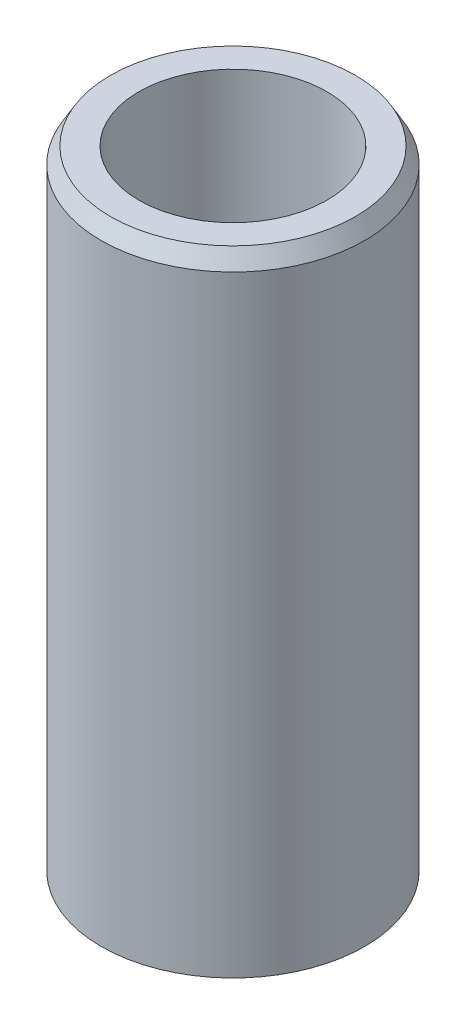
ISO-10303-21;
HEADER;
FILE_DESCRIPTION(('STEP AP214'),'2;1');
FILE_NAME('part.step','',(''),(''),'','','');
FILE_SCHEMA(('AUTOMOTIVE_DESIGN { 1 0 10303 214 1 1 1 1 }'));
ENDSEC;
DATA;
#1=APPLICATION_CONTEXT('core data for automotive mechanical design processes');
#2=APPLICATION_PROTOCOL_DEFINITION('international standard','automotive_design',2000,#1);
#3=PRODUCT_CONTEXT('',#1,'mechanical');
#4=PRODUCT('Part','Part','',(#3));
#5=PRODUCT_RELATED_PRODUCT_CATEGORY('part','',(#4));
#6=PRODUCT_DEFINITION_FORMATION('','',#4);
#7=PRODUCT_DEFINITION_CONTEXT('part definition',#1,'design');
#8=PRODUCT_DEFINITION('design','',#6,#7);
#9=PRODUCT_DEFINITION_SHAPE('','',#8);
#10=(LENGTH_UNIT() NAMED_UNIT(*) SI_UNIT(.MILLI.,.METRE.));
#11=(NAMED_UNIT(*) PLANE_ANGLE_UNIT() SI_UNIT($,.RADIAN.));
#12=(NAMED_UNIT(*) SI_UNIT($,.STERADIAN.) SOLID_ANGLE_UNIT());
#13=UNCERTAINTY_MEASURE_WITH_UNIT(LENGTH_MEASURE(1.E-05),#10,'distance_accuracy_value','');
#14=(GEOMETRIC_REPRESENTATION_CONTEXT(3) GLOBAL_UNCERTAINTY_ASSIGNED_CONTEXT((#13)) GLOBAL_UNIT_ASSIGNED_CONTEXT((#10,
#11,#12)) REPRESENTATION_CONTEXT('',''));
#15=CARTESIAN_POINT('',(0.,0.,0.));
#16=DIRECTION('',(0.,0.,1.));
#17=DIRECTION('',(1.,0.,0.));
#18=AXIS2_PLACEMENT_3D('',#15,#16,#17);
#19=CARTESIAN_POINT('',(0.,72.5231527826411,0.));
#20=DIRECTION('',(0.,-1.,0.));
#21=DIRECTION('',(0.,0.,-1.));
#22=AXIS2_PLACEMENT_3D('',#19,#20,#21);
#23=CYLINDRICAL_SURFACE('',#22,15.);
#24=CARTESIAN_POINT('',(0.,70.6891445540709,0.));
#25=DIRECTION('',(0.,1.,0.));
#26=DIRECTION('',(0.,0.,1.));
#27=AXIS2_PLACEMENT_3D('',#24,#25,#26);
#28=CIRCLE('',#27,15.);
#29=CARTESIAN_POINT('',(0.,70.6891445540709,15.));
#30=VERTEX_POINT('',#29);
#31=EDGE_CURVE('E50',#30,#30,#28,.F.);
#32=ORIENTED_EDGE('',*,*,#31,.T.);
#33=EDGE_LOOP('',(#32));
#34=FACE_BOUND('',#33,.T.);
#35=CARTESIAN_POINT('',(0.,1.05886514446099,0.));
#36=DIRECTION('',(0.,1.,0.));
#37=DIRECTION('',(0.,0.,1.));
#38=AXIS2_PLACEMENT_3D('',#35,#36,#37);
#39=CIRCLE('',#38,15.);
#40=CARTESIAN_POINT('',(0.,1.05886514446099,15.));
#41=VERTEX_POINT('',#40);
#42=EDGE_CURVE('E51',#41,#41,#39,.T.);
#43=ORIENTED_EDGE('',*,*,#42,.T.);
#44=EDGE_LOOP('',(#43));
#45=FACE_BOUND('',#44,.T.);
#46=ADVANCED_FACE('F39',(#34,#45),#23,.T.);
#47=CARTESIAN_POINT('',(0.,72.5231527826411,0.));
#48=DIRECTION('',(0.,1.,0.));
#49=DIRECTION('',(0.,0.,1.));
#50=AXIS2_PLACEMENT_3D('',#47,#48,#49);
#51=PLANE('',#50);
#52=CARTESIAN_POINT('',(0.,72.5231527826411,0.));
#53=DIRECTION('',(0.,1.,0.));
#54=DIRECTION('',(0.,0.,1.));
#55=AXIS2_PLACEMENT_3D('',#52,#53,#54);
#56=CIRCLE('',#55,13.941134855539);
#57=CARTESIAN_POINT('',(0.,72.5231527826411,13.941134855539));
#58=VERTEX_POINT('',#57);
#59=EDGE_CURVE('E54',#58,#58,#56,.T.);
#60=ORIENTED_EDGE('',*,*,#59,.T.);
#61=EDGE_LOOP('',(#60));
#62=FACE_BOUND('',#61,.T.);
#63=CARTESIAN_POINT('',(0.,72.5231527826411,0.));
#64=DIRECTION('',(0.,1.,0.));
#65=DIRECTION('',(0.,0.,1.));
#66=AXIS2_PLACEMENT_3D('',#63,#64,#65);
#67=CIRCLE('',#66,10.7094149764629);
#68=CARTESIAN_POINT('',(0.,72.5231527826411,10.7094149764629));
#69=VERTEX_POINT('',#68);
#70=EDGE_CURVE('E58',#69,#69,#67,.T.);
#71=ORIENTED_EDGE('',*,*,#70,.F.);
#72=EDGE_LOOP('',(#71));
#73=FACE_BOUND('',#72,.T.);
#74=ADVANCED_FACE('F69',(#62,#73),#51,.T.);
#75=CARTESIAN_POINT('',(0.,0.,0.));
#76=DIRECTION('',(0.,1.,0.));
#77=DIRECTION('',(0.,0.,1.));
#78=AXIS2_PLACEMENT_3D('',#75,#76,#77);
#79=PLANE('',#78);
#80=CARTESIAN_POINT('',(0.,0.,0.));
#81=DIRECTION('',(0.,1.,0.));
#82=DIRECTION('',(0.,0.,1.));
#83=AXIS2_PLACEMENT_3D('',#80,#81,#82);
#84=CIRCLE('',#83,13.1659917714298);
#85=CARTESIAN_POINT('',(0.,0.,13.1659917714298));
#86=VERTEX_POINT('',#85);
#87=EDGE_CURVE('E10',#86,#86,#84,.F.);
#88=ORIENTED_EDGE('',*,*,#87,.T.);
#89=EDGE_LOOP('',(#88));
#90=FACE_BOUND('',#89,.T.);
#91=CARTESIAN_POINT('',(0.,0.,0.));
#92=DIRECTION('',(0.,1.,0.));
#93=DIRECTION('',(0.,0.,1.));
#94=AXIS2_PLACEMENT_3D('',#91,#92,#93);
#95=CIRCLE('',#94,10.7094149764629);
#96=CARTESIAN_POINT('',(0.,0.,10.7094149764629));
#97=VERTEX_POINT('',#96);
#98=EDGE_CURVE('E63',#97,#97,#95,.T.);
#99=ORIENTED_EDGE('',*,*,#98,.T.);
#100=EDGE_LOOP('',(#99));
#101=FACE_BOUND('',#100,.T.);
#102=ADVANCED_FACE('F75',(#90,#101),#79,.F.);
#103=CARTESIAN_POINT('',(0.,72.5231527826411,0.));
#104=DIRECTION('',(0.,-1.,0.));
#105=DIRECTION('',(0.,0.,-1.));
#106=AXIS2_PLACEMENT_3D('',#103,#104,#105);
#107=CYLINDRICAL_SURFACE('',#106,10.7094149764629);
#108=ORIENTED_EDGE('',*,*,#70,.T.);
#109=EDGE_LOOP('',(#108));
#110=FACE_BOUND('',#109,.T.);
#111=ORIENTED_EDGE('',*,*,#98,.F.);
#112=EDGE_LOOP('',(#111));
#113=FACE_BOUND('',#112,.T.);
#114=ADVANCED_FACE('F70',(#110,#113),#107,.F.);
#115=CARTESIAN_POINT('',(0.,72.5231527826411,0.));
#116=DIRECTION('',(0.,-1.,0.));
#117=DIRECTION('',(0.,0.,-1.));
#118=AXIS2_PLACEMENT_3D('',#115,#116,#117);
#119=CONICAL_SURFACE('',#118,13.941134855539,0.523598775598296);
#120=ORIENTED_EDGE('',*,*,#31,.F.);
#121=EDGE_LOOP('',(#120));
#122=FACE_BOUND('',#121,.T.);
#123=ORIENTED_EDGE('',*,*,#59,.F.);
#124=EDGE_LOOP('',(#123));
#125=FACE_BOUND('',#124,.T.);
#126=ADVANCED_FACE('F81',(#122,#125),#119,.T.);
#127=CARTESIAN_POINT('',(0.,1.05886514446099,0.));
#128=DIRECTION('',(0.,1.,0.));
#129=DIRECTION('',(0.,0.,1.));
#130=AXIS2_PLACEMENT_3D('',#127,#128,#129);
#131=CONICAL_SURFACE('',#130,15.,1.0471975511966);
#132=ORIENTED_EDGE('',*,*,#87,.F.);
#133=EDGE_LOOP('',(#132));
#134=FACE_BOUND('',#133,.T.);
#135=ORIENTED_EDGE('',*,*,#42,.F.);
#136=EDGE_LOOP('',(#135));
#137=FACE_BOUND('',#136,.T.);
#138=ADVANCED_FACE('F45',(#134,#137),#131,.T.);
#139=CLOSED_SHELL('',(#46,#74,#102,#114,#126,#138));
#140=MANIFOLD_SOLID_BREP('B2',#139);
#141=ADVANCED_BREP_SHAPE_REPRESENTATION('',(#18,#140),#14);
#142=SHAPE_DEFINITION_REPRESENTATION(#9,#141);
ENDSEC;
END-ISO-10303-21;
